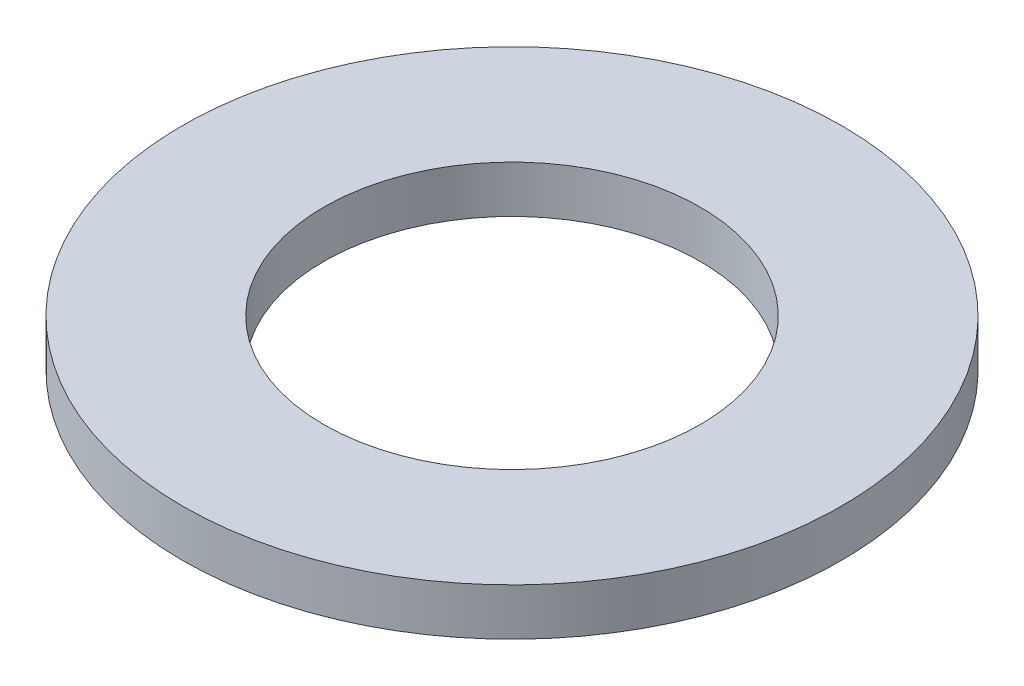
ISO-10303-21;
HEADER;
FILE_DESCRIPTION(('STEP AP214'),'2;1');
FILE_NAME('part.step','',(''),(''),'','','');
FILE_SCHEMA(('AUTOMOTIVE_DESIGN { 1 0 10303 214 1 1 1 1 }'));
ENDSEC;
DATA;
#1=APPLICATION_CONTEXT('core data for automotive mechanical design processes');
#2=APPLICATION_PROTOCOL_DEFINITION('international standard','automotive_design',2000,#1);
#3=PRODUCT_CONTEXT('',#1,'mechanical');
#4=PRODUCT('Part','Part','',(#3));
#5=PRODUCT_RELATED_PRODUCT_CATEGORY('part','',(#4));
#6=PRODUCT_DEFINITION_FORMATION('','',#4);
#7=PRODUCT_DEFINITION_CONTEXT('part definition',#1,'design');
#8=PRODUCT_DEFINITION('design','',#6,#7);
#9=PRODUCT_DEFINITION_SHAPE('','',#8);
#10=(LENGTH_UNIT() NAMED_UNIT(*) SI_UNIT(.MILLI.,.METRE.));
#11=(NAMED_UNIT(*) PLANE_ANGLE_UNIT() SI_UNIT($,.RADIAN.));
#12=(NAMED_UNIT(*) SI_UNIT($,.STERADIAN.) SOLID_ANGLE_UNIT());
#13=UNCERTAINTY_MEASURE_WITH_UNIT(LENGTH_MEASURE(1.E-05),#10,'distance_accuracy_value','');
#14=(GEOMETRIC_REPRESENTATION_CONTEXT(3) GLOBAL_UNCERTAINTY_ASSIGNED_CONTEXT((#13)) GLOBAL_UNIT_ASSIGNED_CONTEXT((#10,
#11,#12)) REPRESENTATION_CONTEXT('',''));
#15=CARTESIAN_POINT('',(0.,0.,0.));
#16=DIRECTION('',(0.,0.,1.));
#17=DIRECTION('',(1.,0.,0.));
#18=AXIS2_PLACEMENT_3D('',#15,#16,#17);
#19=CARTESIAN_POINT('',(0.,1.,0.));
#20=DIRECTION('',(0.,-1.,0.));
#21=DIRECTION('',(0.,0.,-1.));
#22=AXIS2_PLACEMENT_3D('',#19,#20,#21);
#23=CYLINDRICAL_SURFACE('',#22,7.);
#24=CARTESIAN_POINT('',(0.,1.,0.));
#25=DIRECTION('',(0.,1.,0.));
#26=DIRECTION('',(0.,0.,1.));
#27=AXIS2_PLACEMENT_3D('',#24,#25,#26);
#28=CIRCLE('',#27,7.);
#29=CARTESIAN_POINT('',(0.,1.,7.));
#30=VERTEX_POINT('',#29);
#31=EDGE_CURVE('E10',#30,#30,#28,.T.);
#32=ORIENTED_EDGE('',*,*,#31,.F.);
#33=EDGE_LOOP('',(#32));
#34=FACE_BOUND('',#33,.T.);
#35=CARTESIAN_POINT('',(0.,0.,0.));
#36=DIRECTION('',(0.,1.,0.));
#37=DIRECTION('',(0.,0.,1.));
#38=AXIS2_PLACEMENT_3D('',#35,#36,#37);
#39=CIRCLE('',#38,7.);
#40=CARTESIAN_POINT('',(0.,0.,7.));
#41=VERTEX_POINT('',#40);
#42=EDGE_CURVE('E17',#41,#41,#39,.T.);
#43=ORIENTED_EDGE('',*,*,#42,.T.);
#44=EDGE_LOOP('',(#43));
#45=FACE_BOUND('',#44,.T.);
#46=ADVANCED_FACE('F14',(#34,#45),#23,.T.);
#47=CARTESIAN_POINT('',(0.,1.,0.));
#48=DIRECTION('',(0.,1.,0.));
#49=DIRECTION('',(0.,0.,1.));
#50=AXIS2_PLACEMENT_3D('',#47,#48,#49);
#51=PLANE('',#50);
#52=CARTESIAN_POINT('',(0.,1.,0.));
#53=DIRECTION('',(0.,1.,0.));
#54=DIRECTION('',(0.,0.,1.));
#55=AXIS2_PLACEMENT_3D('',#52,#53,#54);
#56=CIRCLE('',#55,4.);
#57=CARTESIAN_POINT('',(0.,1.,4.));
#58=VERTEX_POINT('',#57);
#59=EDGE_CURVE('E26',#58,#58,#56,.T.);
#60=ORIENTED_EDGE('',*,*,#59,.F.);
#61=EDGE_LOOP('',(#60));
#62=FACE_BOUND('',#61,.T.);
#63=ORIENTED_EDGE('',*,*,#31,.T.);
#64=EDGE_LOOP('',(#63));
#65=FACE_BOUND('',#64,.T.);
#66=ADVANCED_FACE('F41',(#62,#65),#51,.T.);
#67=CARTESIAN_POINT('',(0.,0.,0.));
#68=DIRECTION('',(0.,1.,0.));
#69=DIRECTION('',(0.,0.,1.));
#70=AXIS2_PLACEMENT_3D('',#67,#68,#69);
#71=PLANE('',#70);
#72=CARTESIAN_POINT('',(0.,0.,0.));
#73=DIRECTION('',(0.,1.,0.));
#74=DIRECTION('',(0.,0.,1.));
#75=AXIS2_PLACEMENT_3D('',#72,#73,#74);
#76=CIRCLE('',#75,4.);
#77=CARTESIAN_POINT('',(0.,0.,4.));
#78=VERTEX_POINT('',#77);
#79=EDGE_CURVE('E24',#78,#78,#76,.T.);
#80=ORIENTED_EDGE('',*,*,#79,.T.);
#81=EDGE_LOOP('',(#80));
#82=FACE_BOUND('',#81,.T.);
#83=ORIENTED_EDGE('',*,*,#42,.F.);
#84=EDGE_LOOP('',(#83));
#85=FACE_BOUND('',#84,.T.);
#86=ADVANCED_FACE('F32',(#82,#85),#71,.F.);
#87=CARTESIAN_POINT('',(0.,0.,0.));
#88=DIRECTION('',(0.,1.,0.));
#89=DIRECTION('',(0.,0.,1.));
#90=AXIS2_PLACEMENT_3D('',#87,#88,#89);
#91=CYLINDRICAL_SURFACE('',#90,4.);
#92=ORIENTED_EDGE('',*,*,#79,.F.);
#93=EDGE_LOOP('',(#92));
#94=FACE_BOUND('',#93,.T.);
#95=ORIENTED_EDGE('',*,*,#59,.T.);
#96=EDGE_LOOP('',(#95));
#97=FACE_BOUND('',#96,.T.);
#98=ADVANCED_FACE('F35',(#94,#97),#91,.F.);
#99=CLOSED_SHELL('',(#46,#66,#86,#98));
#100=MANIFOLD_SOLID_BREP('B1',#99);
#101=ADVANCED_BREP_SHAPE_REPRESENTATION('',(#18,#100),#14);
#102=SHAPE_DEFINITION_REPRESENTATION(#9,#101);
ENDSEC;
END-ISO-10303-21;
